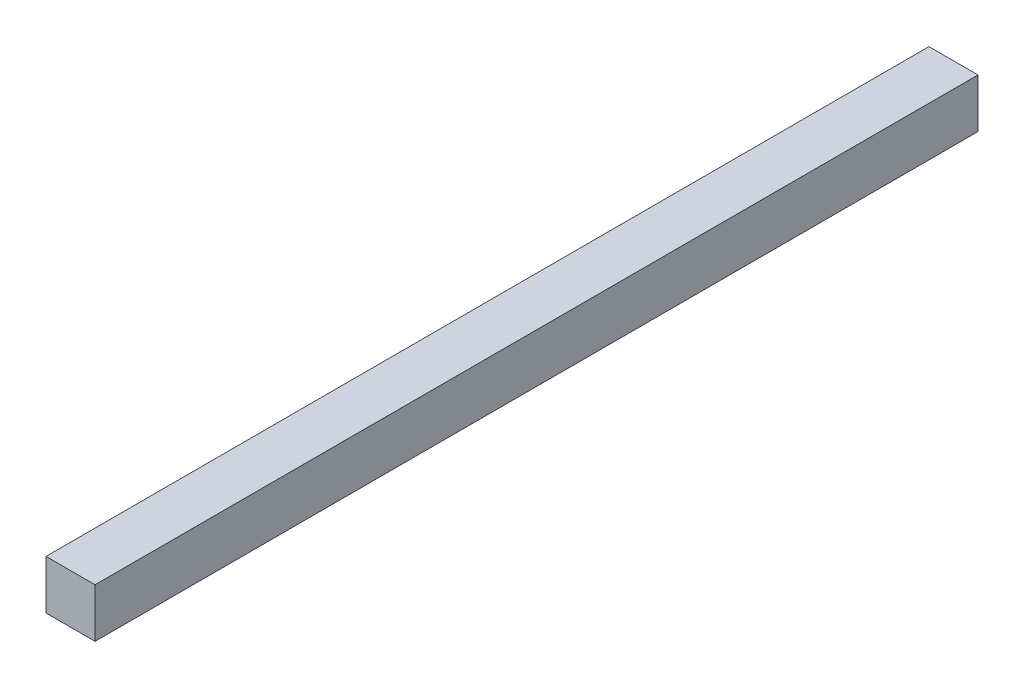
ISO-10303-21;
HEADER;
FILE_DESCRIPTION(('STEP AP214'),'2;1');
FILE_NAME('part.step','',(''),(''),'','','');
FILE_SCHEMA(('AUTOMOTIVE_DESIGN { 1 0 10303 214 1 1 1 1 }'));
ENDSEC;
DATA;
#1=APPLICATION_CONTEXT('core data for automotive mechanical design processes');
#2=APPLICATION_PROTOCOL_DEFINITION('international standard','automotive_design',2000,#1);
#3=PRODUCT_CONTEXT('',#1,'mechanical');
#4=PRODUCT('Part','Part','',(#3));
#5=PRODUCT_RELATED_PRODUCT_CATEGORY('part','',(#4));
#6=PRODUCT_DEFINITION_FORMATION('','',#4);
#7=PRODUCT_DEFINITION_CONTEXT('part definition',#1,'design');
#8=PRODUCT_DEFINITION('design','',#6,#7);
#9=PRODUCT_DEFINITION_SHAPE('','',#8);
#10=(LENGTH_UNIT() NAMED_UNIT(*) SI_UNIT(.MILLI.,.METRE.));
#11=(NAMED_UNIT(*) PLANE_ANGLE_UNIT() SI_UNIT($,.RADIAN.));
#12=(NAMED_UNIT(*) SI_UNIT($,.STERADIAN.) SOLID_ANGLE_UNIT());
#13=UNCERTAINTY_MEASURE_WITH_UNIT(LENGTH_MEASURE(1.E-05),#10,'distance_accuracy_value','');
#14=(GEOMETRIC_REPRESENTATION_CONTEXT(3) GLOBAL_UNCERTAINTY_ASSIGNED_CONTEXT((#13)) GLOBAL_UNIT_ASSIGNED_CONTEXT((#10,
#11,#12)) REPRESENTATION_CONTEXT('',''));
#15=CARTESIAN_POINT('',(0.,0.,0.));
#16=DIRECTION('',(0.,0.,1.));
#17=DIRECTION('',(1.,0.,0.));
#18=AXIS2_PLACEMENT_3D('',#15,#16,#17);
#19=CARTESIAN_POINT('',(7.5,-7.5,270.));
#20=DIRECTION('',(-1.,0.,0.));
#21=DIRECTION('',(0.,0.,1.));
#22=AXIS2_PLACEMENT_3D('',#19,#20,#21);
#23=PLANE('',#22);
#24=DIRECTION('',(0.,1.,0.));
#25=VECTOR('',#24,1.);
#26=CARTESIAN_POINT('',(7.5,-7.5,0.));
#27=LINE('',#26,#25);
#28=CARTESIAN_POINT('',(7.5,-7.5,0.));
#29=VERTEX_POINT('',#28);
#30=CARTESIAN_POINT('',(7.5,7.5,0.));
#31=VERTEX_POINT('',#30);
#32=EDGE_CURVE('E98',#29,#31,#27,.T.);
#33=ORIENTED_EDGE('',*,*,#32,.T.);
#34=DIRECTION('',(0.,0.,-1.));
#35=VECTOR('',#34,1.);
#36=CARTESIAN_POINT('',(7.5,7.5,270.));
#37=LINE('',#36,#35);
#38=CARTESIAN_POINT('',(7.5,7.5,270.));
#39=VERTEX_POINT('',#38);
#40=EDGE_CURVE('E11',#39,#31,#37,.T.);
#41=ORIENTED_EDGE('',*,*,#40,.F.);
#42=DIRECTION('',(0.,1.,0.));
#43=VECTOR('',#42,1.);
#44=CARTESIAN_POINT('',(7.5,-7.5,270.));
#45=LINE('',#44,#43);
#46=CARTESIAN_POINT('',(7.5,-7.5,270.));
#47=VERTEX_POINT('',#46);
#48=EDGE_CURVE('E86',#47,#39,#45,.T.);
#49=ORIENTED_EDGE('',*,*,#48,.F.);
#50=DIRECTION('',(0.,0.,-1.));
#51=VECTOR('',#50,1.);
#52=CARTESIAN_POINT('',(7.5,-7.5,270.));
#53=LINE('',#52,#51);
#54=EDGE_CURVE('E94',#47,#29,#53,.T.);
#55=ORIENTED_EDGE('',*,*,#54,.T.);
#56=EDGE_LOOP('',(#33,#41,#49,#55));
#57=FACE_BOUND('',#56,.T.);
#58=ADVANCED_FACE('F35',(#57),#23,.F.);
#59=CARTESIAN_POINT('',(-7.5,7.5,270.));
#60=DIRECTION('',(0.,-1.,0.));
#61=DIRECTION('',(0.,0.,-1.));
#62=AXIS2_PLACEMENT_3D('',#59,#60,#61);
#63=PLANE('',#62);
#64=DIRECTION('',(-1.,0.,0.));
#65=VECTOR('',#64,1.);
#66=CARTESIAN_POINT('',(-7.5,7.5,0.));
#67=LINE('',#66,#65);
#68=CARTESIAN_POINT('',(-7.5,7.5,0.));
#69=VERTEX_POINT('',#68);
#70=EDGE_CURVE('E90',#31,#69,#67,.T.);
#71=ORIENTED_EDGE('',*,*,#70,.T.);
#72=DIRECTION('',(0.,0.,-1.));
#73=VECTOR('',#72,1.);
#74=CARTESIAN_POINT('',(-7.5,7.5,270.));
#75=LINE('',#74,#73);
#76=CARTESIAN_POINT('',(-7.5,7.5,270.));
#77=VERTEX_POINT('',#76);
#78=EDGE_CURVE('E43',#77,#69,#75,.T.);
#79=ORIENTED_EDGE('',*,*,#78,.F.);
#80=DIRECTION('',(-1.,0.,0.));
#81=VECTOR('',#80,1.);
#82=CARTESIAN_POINT('',(-7.5,7.5,270.));
#83=LINE('',#82,#81);
#84=EDGE_CURVE('E81',#39,#77,#83,.T.);
#85=ORIENTED_EDGE('',*,*,#84,.F.);
#86=ORIENTED_EDGE('',*,*,#40,.T.);
#87=EDGE_LOOP('',(#71,#79,#85,#86));
#88=FACE_BOUND('',#87,.T.);
#89=ADVANCED_FACE('F89',(#88),#63,.F.);
#90=CARTESIAN_POINT('',(-7.5,-7.5,270.));
#91=DIRECTION('',(1.,0.,0.));
#92=DIRECTION('',(0.,0.,-1.));
#93=AXIS2_PLACEMENT_3D('',#90,#91,#92);
#94=PLANE('',#93);
#95=DIRECTION('',(0.,-1.,0.));
#96=VECTOR('',#95,1.);
#97=CARTESIAN_POINT('',(-7.5,-7.5,0.));
#98=LINE('',#97,#96);
#99=CARTESIAN_POINT('',(-7.5,-7.5,0.));
#100=VERTEX_POINT('',#99);
#101=EDGE_CURVE('E68',#69,#100,#98,.T.);
#102=ORIENTED_EDGE('',*,*,#101,.T.);
#103=DIRECTION('',(0.,0.,-1.));
#104=VECTOR('',#103,1.);
#105=CARTESIAN_POINT('',(-7.5,-7.5,270.));
#106=LINE('',#105,#104);
#107=CARTESIAN_POINT('',(-7.5,-7.5,270.));
#108=VERTEX_POINT('',#107);
#109=EDGE_CURVE('E91',#108,#100,#106,.T.);
#110=ORIENTED_EDGE('',*,*,#109,.F.);
#111=DIRECTION('',(0.,-1.,0.));
#112=VECTOR('',#111,1.);
#113=CARTESIAN_POINT('',(-7.5,-7.5,270.));
#114=LINE('',#113,#112);
#115=EDGE_CURVE('E84',#77,#108,#114,.T.);
#116=ORIENTED_EDGE('',*,*,#115,.F.);
#117=ORIENTED_EDGE('',*,*,#78,.T.);
#118=EDGE_LOOP('',(#102,#110,#116,#117));
#119=FACE_BOUND('',#118,.T.);
#120=ADVANCED_FACE('F92',(#119),#94,.F.);
#121=CARTESIAN_POINT('',(-7.5,-7.5,270.));
#122=DIRECTION('',(0.,1.,0.));
#123=DIRECTION('',(0.,0.,1.));
#124=AXIS2_PLACEMENT_3D('',#121,#122,#123);
#125=PLANE('',#124);
#126=DIRECTION('',(1.,0.,0.));
#127=VECTOR('',#126,1.);
#128=CARTESIAN_POINT('',(-7.5,-7.5,0.));
#129=LINE('',#128,#127);
#130=EDGE_CURVE('E74',#100,#29,#129,.T.);
#131=ORIENTED_EDGE('',*,*,#130,.T.);
#132=ORIENTED_EDGE('',*,*,#54,.F.);
#133=DIRECTION('',(1.,0.,0.));
#134=VECTOR('',#133,1.);
#135=CARTESIAN_POINT('',(-7.5,-7.5,270.));
#136=LINE('',#135,#134);
#137=EDGE_CURVE('E51',#108,#47,#136,.T.);
#138=ORIENTED_EDGE('',*,*,#137,.F.);
#139=ORIENTED_EDGE('',*,*,#109,.T.);
#140=EDGE_LOOP('',(#131,#132,#138,#139));
#141=FACE_BOUND('',#140,.T.);
#142=ADVANCED_FACE('F105',(#141),#125,.F.);
#143=CARTESIAN_POINT('',(0.,0.,270.));
#144=DIRECTION('',(0.,0.,-1.));
#145=DIRECTION('',(-1.,0.,0.));
#146=AXIS2_PLACEMENT_3D('',#143,#144,#145);
#147=PLANE('',#146);
#148=ORIENTED_EDGE('',*,*,#48,.T.);
#149=ORIENTED_EDGE('',*,*,#84,.T.);
#150=ORIENTED_EDGE('',*,*,#115,.T.);
#151=ORIENTED_EDGE('',*,*,#137,.T.);
#152=EDGE_LOOP('',(#148,#149,#150,#151));
#153=FACE_BOUND('',#152,.T.);
#154=ADVANCED_FACE('F82',(#153),#147,.F.);
#155=CARTESIAN_POINT('',(0.,0.,0.));
#156=DIRECTION('',(0.,0.,-1.));
#157=DIRECTION('',(-1.,0.,0.));
#158=AXIS2_PLACEMENT_3D('',#155,#156,#157);
#159=PLANE('',#158);
#160=ORIENTED_EDGE('',*,*,#32,.F.);
#161=ORIENTED_EDGE('',*,*,#130,.F.);
#162=ORIENTED_EDGE('',*,*,#101,.F.);
#163=ORIENTED_EDGE('',*,*,#70,.F.);
#164=EDGE_LOOP('',(#160,#161,#162,#163));
#165=FACE_BOUND('',#164,.T.);
#166=ADVANCED_FACE('F108',(#165),#159,.T.);
#167=CLOSED_SHELL('',(#58,#89,#120,#142,#154,#166));
#168=MANIFOLD_SOLID_BREP('B2',#167);
#169=ADVANCED_BREP_SHAPE_REPRESENTATION('',(#18,#168),#14);
#170=SHAPE_DEFINITION_REPRESENTATION(#9,#169);
ENDSEC;
END-ISO-10303-21;
